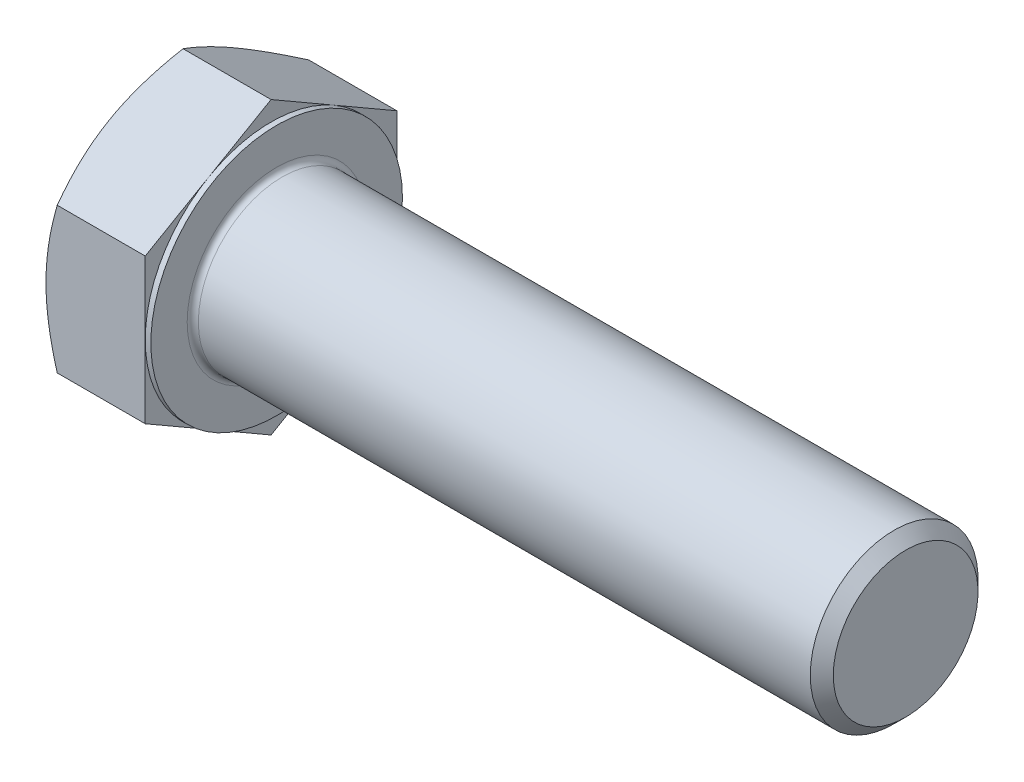
ISO-10303-21;
HEADER;
FILE_DESCRIPTION(('STEP AP214'),'2;1');
FILE_NAME('part.step','',(''),(''),'','','');
FILE_SCHEMA(('AUTOMOTIVE_DESIGN { 1 0 10303 214 1 1 1 1 }'));
ENDSEC;
DATA;
#1=APPLICATION_CONTEXT('core data for automotive mechanical design processes');
#2=APPLICATION_PROTOCOL_DEFINITION('international standard','automotive_design',2000,#1);
#3=PRODUCT_CONTEXT('',#1,'mechanical');
#4=PRODUCT('Part','Part','',(#3));
#5=PRODUCT_RELATED_PRODUCT_CATEGORY('part','',(#4));
#6=PRODUCT_DEFINITION_FORMATION('','',#4);
#7=PRODUCT_DEFINITION_CONTEXT('part definition',#1,'design');
#8=PRODUCT_DEFINITION('design','',#6,#7);
#9=PRODUCT_DEFINITION_SHAPE('','',#8);
#10=(LENGTH_UNIT() NAMED_UNIT(*) SI_UNIT(.MILLI.,.METRE.));
#11=(NAMED_UNIT(*) PLANE_ANGLE_UNIT() SI_UNIT($,.RADIAN.));
#12=(NAMED_UNIT(*) SI_UNIT($,.STERADIAN.) SOLID_ANGLE_UNIT());
#13=UNCERTAINTY_MEASURE_WITH_UNIT(LENGTH_MEASURE(1.E-05),#10,'distance_accuracy_value','');
#14=(GEOMETRIC_REPRESENTATION_CONTEXT(3) GLOBAL_UNCERTAINTY_ASSIGNED_CONTEXT((#13)) GLOBAL_UNIT_ASSIGNED_CONTEXT((#10,
#11,#12)) REPRESENTATION_CONTEXT('',''));
#15=CARTESIAN_POINT('',(0.,0.,0.));
#16=DIRECTION('',(0.,0.,1.));
#17=DIRECTION('',(1.,0.,0.));
#18=AXIS2_PLACEMENT_3D('',#15,#16,#17);
#19=CARTESIAN_POINT('',(15.,20.7846096908265,0.));
#20=DIRECTION('',(1.,0.,0.));
#21=DIRECTION('',(0.,0.,-1.));
#22=AXIS2_PLACEMENT_3D('',#19,#20,#21);
#23=PLANE('',#22);
#24=CARTESIAN_POINT('',(15.,0.,0.));
#25=DIRECTION('',(1.,0.,0.));
#26=DIRECTION('',(0.,0.,-1.));
#27=AXIS2_PLACEMENT_3D('',#24,#25,#26);
#28=CIRCLE('',#27,12.8);
#29=CARTESIAN_POINT('',(15.,0.,-12.8));
#30=VERTEX_POINT('',#29);
#31=EDGE_CURVE('E43',#30,#30,#28,.F.);
#32=ORIENTED_EDGE('',*,*,#31,.T.);
#33=EDGE_LOOP('',(#32));
#34=FACE_BOUND('',#33,.T.);
#35=CARTESIAN_POINT('',(15.,0.,0.));
#36=DIRECTION('',(1.,0.,0.));
#37=DIRECTION('',(0.,0.,-1.));
#38=AXIS2_PLACEMENT_3D('',#35,#36,#37);
#39=CIRCLE('',#38,18.);
#40=CARTESIAN_POINT('',(15.,0.,-18.));
#41=VERTEX_POINT('',#40);
#42=EDGE_CURVE('E294',#41,#41,#39,.T.);
#43=ORIENTED_EDGE('',*,*,#42,.T.);
#44=EDGE_LOOP('',(#43));
#45=FACE_BOUND('',#44,.T.);
#46=ADVANCED_FACE('F35',(#34,#45),#23,.T.);
#47=CARTESIAN_POINT('',(0.,0.,0.));
#48=DIRECTION('',(-1.,0.,0.));
#49=DIRECTION('',(0.,0.,1.));
#50=AXIS2_PLACEMENT_3D('',#47,#48,#49);
#51=CYLINDRICAL_SURFACE('',#50,12.);
#52=CARTESIAN_POINT('',(15.8,0.,0.));
#53=DIRECTION('',(1.,0.,0.));
#54=DIRECTION('',(0.,0.,-1.));
#55=AXIS2_PLACEMENT_3D('',#52,#53,#54);
#56=CIRCLE('',#55,12.);
#57=CARTESIAN_POINT('',(15.8,0.,-12.));
#58=VERTEX_POINT('',#57);
#59=EDGE_CURVE('E11',#58,#58,#56,.T.);
#60=ORIENTED_EDGE('',*,*,#59,.T.);
#61=EDGE_LOOP('',(#60));
#62=FACE_BOUND('',#61,.T.);
#63=CARTESIAN_POINT('',(103.352,0.,0.));
#64=DIRECTION('',(-1.,0.,0.));
#65=DIRECTION('',(0.,0.,1.));
#66=AXIS2_PLACEMENT_3D('',#63,#64,#65);
#67=CIRCLE('',#66,12.);
#68=CARTESIAN_POINT('',(103.352,0.,12.));
#69=VERTEX_POINT('',#68);
#70=EDGE_CURVE('E273',#69,#69,#67,.T.);
#71=ORIENTED_EDGE('',*,*,#70,.T.);
#72=EDGE_LOOP('',(#71));
#73=FACE_BOUND('',#72,.T.);
#74=ADVANCED_FACE('F247',(#62,#73),#51,.T.);
#75=CARTESIAN_POINT('',(105.,0.,0.));
#76=DIRECTION('',(-1.,0.,0.));
#77=DIRECTION('',(0.,0.,1.));
#78=AXIS2_PLACEMENT_3D('',#75,#76,#77);
#79=CONICAL_SURFACE('',#78,10.352,0.785398163397449);
#80=ORIENTED_EDGE('',*,*,#70,.F.);
#81=EDGE_LOOP('',(#80));
#82=FACE_BOUND('',#81,.T.);
#83=CARTESIAN_POINT('',(105.,0.,0.));
#84=DIRECTION('',(-1.,0.,0.));
#85=DIRECTION('',(0.,0.,1.));
#86=AXIS2_PLACEMENT_3D('',#83,#84,#85);
#87=CIRCLE('',#86,10.352);
#88=CARTESIAN_POINT('',(105.,0.,10.352));
#89=VERTEX_POINT('',#88);
#90=EDGE_CURVE('E271',#89,#89,#87,.T.);
#91=ORIENTED_EDGE('',*,*,#90,.T.);
#92=EDGE_LOOP('',(#91));
#93=FACE_BOUND('',#92,.T.);
#94=ADVANCED_FACE('F252',(#82,#93),#79,.T.);
#95=CARTESIAN_POINT('',(105.,0.,0.));
#96=DIRECTION('',(-1.,0.,0.));
#97=DIRECTION('',(0.,0.,1.));
#98=AXIS2_PLACEMENT_3D('',#95,#96,#97);
#99=PLANE('',#98);
#100=ORIENTED_EDGE('',*,*,#90,.F.);
#101=EDGE_LOOP('',(#100));
#102=FACE_BOUND('',#101,.T.);
#103=ADVANCED_FACE('F259',(#102),#99,.F.);
#104=CARTESIAN_POINT('',(14.2,18.,0.));
#105=DIRECTION('',(1.,0.,0.));
#106=DIRECTION('',(0.,0.,-1.));
#107=AXIS2_PLACEMENT_3D('',#104,#105,#106);
#108=PLANE('',#107);
#109=DIRECTION('',(0.,0.500000000000001,0.866025403784438));
#110=VECTOR('',#109,1.);
#111=CARTESIAN_POINT('',(14.2,10.3923048454132,-18.));
#112=LINE('',#111,#110);
#113=CARTESIAN_POINT('',(14.2,10.3923048454132,-18.));
#114=VERTEX_POINT('',#113);
#115=CARTESIAN_POINT('',(14.2,15.5884572681199,-9.00000000000002));
#116=VERTEX_POINT('',#115);
#117=EDGE_CURVE('E167',#114,#116,#112,.T.);
#118=ORIENTED_EDGE('',*,*,#117,.T.);
#119=CARTESIAN_POINT('',(14.2,0.,0.));
#120=DIRECTION('',(-1.,0.,0.));
#121=DIRECTION('',(0.,0.,1.));
#122=AXIS2_PLACEMENT_3D('',#119,#120,#121);
#123=CIRCLE('',#122,18.);
#124=CARTESIAN_POINT('',(14.2,0.,-18.));
#125=VERTEX_POINT('',#124);
#126=EDGE_CURVE('E50',#116,#125,#123,.T.);
#127=ORIENTED_EDGE('',*,*,#126,.T.);
#128=DIRECTION('',(0.,1.,0.));
#129=VECTOR('',#128,1.);
#130=CARTESIAN_POINT('',(14.2,10.3923048454132,-18.));
#131=LINE('',#130,#129);
#132=EDGE_CURVE('E297',#125,#114,#131,.T.);
#133=ORIENTED_EDGE('',*,*,#132,.T.);
#134=EDGE_LOOP('',(#118,#127,#133));
#135=FACE_BOUND('',#134,.T.);
#136=ADVANCED_FACE('F262',(#135),#108,.T.);
#137=CARTESIAN_POINT('',(14.2,20.7846096908265,0.));
#138=VERTEX_POINT('',#137);
#139=EDGE_CURVE('E165',#116,#138,#112,.T.);
#140=ORIENTED_EDGE('',*,*,#139,.T.);
#141=DIRECTION('',(0.,-0.500000000000001,0.866025403784438));
#142=VECTOR('',#141,1.);
#143=CARTESIAN_POINT('',(14.2,20.7846096908265,0.));
#144=LINE('',#143,#142);
#145=CARTESIAN_POINT('',(14.2,15.5884572681199,9.00000000000002));
#146=VERTEX_POINT('',#145);
#147=EDGE_CURVE('E164',#138,#146,#144,.T.);
#148=ORIENTED_EDGE('',*,*,#147,.T.);
#149=EDGE_CURVE('E153',#146,#116,#123,.T.);
#150=ORIENTED_EDGE('',*,*,#149,.T.);
#151=EDGE_LOOP('',(#140,#148,#150));
#152=FACE_BOUND('',#151,.T.);
#153=ADVANCED_FACE('F267',(#152),#108,.T.);
#154=CARTESIAN_POINT('',(14.2,10.3923048454133,18.));
#155=VERTEX_POINT('',#154);
#156=EDGE_CURVE('E132',#146,#155,#144,.T.);
#157=ORIENTED_EDGE('',*,*,#156,.T.);
#158=DIRECTION('',(0.,-1.,0.));
#159=VECTOR('',#158,1.);
#160=CARTESIAN_POINT('',(14.2,10.3923048454133,18.));
#161=LINE('',#160,#159);
#162=CARTESIAN_POINT('',(14.2,0.,18.));
#163=VERTEX_POINT('',#162);
#164=EDGE_CURVE('E126',#155,#163,#161,.T.);
#165=ORIENTED_EDGE('',*,*,#164,.T.);
#166=EDGE_CURVE('E130',#163,#146,#123,.T.);
#167=ORIENTED_EDGE('',*,*,#166,.T.);
#168=EDGE_LOOP('',(#157,#165,#167));
#169=FACE_BOUND('',#168,.T.);
#170=ADVANCED_FACE('F128',(#169),#108,.T.);
#171=CARTESIAN_POINT('',(14.2,-10.3923048454132,18.));
#172=VERTEX_POINT('',#171);
#173=EDGE_CURVE('E136',#163,#172,#161,.T.);
#174=ORIENTED_EDGE('',*,*,#173,.T.);
#175=DIRECTION('',(0.,-0.500000000000002,-0.866025403784438));
#176=VECTOR('',#175,1.);
#177=CARTESIAN_POINT('',(14.2,-20.7846096908265,0.));
#178=LINE('',#177,#176);
#179=CARTESIAN_POINT('',(14.2,-15.5884572681199,9.00000000000003));
#180=VERTEX_POINT('',#179);
#181=EDGE_CURVE('E143',#172,#180,#178,.T.);
#182=ORIENTED_EDGE('',*,*,#181,.T.);
#183=EDGE_CURVE('E140',#180,#163,#123,.T.);
#184=ORIENTED_EDGE('',*,*,#183,.T.);
#185=EDGE_LOOP('',(#174,#182,#184));
#186=FACE_BOUND('',#185,.T.);
#187=ADVANCED_FACE('F141',(#186),#108,.T.);
#188=CARTESIAN_POINT('',(14.2,-20.7846096908265,0.));
#189=VERTEX_POINT('',#188);
#190=EDGE_CURVE('E159',#180,#189,#178,.T.);
#191=ORIENTED_EDGE('',*,*,#190,.T.);
#192=DIRECTION('',(0.,0.5,-0.866025403784439));
#193=VECTOR('',#192,1.);
#194=CARTESIAN_POINT('',(14.2,-10.3923048454133,-18.));
#195=LINE('',#194,#193);
#196=CARTESIAN_POINT('',(14.2,-15.5884572681199,-8.99999999999999));
#197=VERTEX_POINT('',#196);
#198=EDGE_CURVE('E335',#189,#197,#195,.T.);
#199=ORIENTED_EDGE('',*,*,#198,.T.);
#200=EDGE_CURVE('E147',#197,#180,#123,.T.);
#201=ORIENTED_EDGE('',*,*,#200,.T.);
#202=EDGE_LOOP('',(#191,#199,#201));
#203=FACE_BOUND('',#202,.T.);
#204=ADVANCED_FACE('F336',(#203),#108,.T.);
#205=CARTESIAN_POINT('',(14.2,-10.3923048454133,-18.));
#206=VERTEX_POINT('',#205);
#207=EDGE_CURVE('E154',#197,#206,#195,.T.);
#208=ORIENTED_EDGE('',*,*,#207,.T.);
#209=EDGE_CURVE('E298',#206,#125,#131,.T.);
#210=ORIENTED_EDGE('',*,*,#209,.T.);
#211=EDGE_CURVE('E305',#125,#197,#123,.T.);
#212=ORIENTED_EDGE('',*,*,#211,.T.);
#213=EDGE_LOOP('',(#208,#210,#212));
#214=FACE_BOUND('',#213,.T.);
#215=ADVANCED_FACE('F268',(#214),#108,.T.);
#216=CARTESIAN_POINT('',(0.,0.,0.));
#217=DIRECTION('',(-1.,0.,0.));
#218=DIRECTION('',(0.,0.,1.));
#219=AXIS2_PLACEMENT_3D('',#216,#217,#218);
#220=CYLINDRICAL_SURFACE('',#219,18.);
#221=ORIENTED_EDGE('',*,*,#126,.F.);
#222=ORIENTED_EDGE('',*,*,#149,.F.);
#223=ORIENTED_EDGE('',*,*,#166,.F.);
#224=ORIENTED_EDGE('',*,*,#183,.F.);
#225=ORIENTED_EDGE('',*,*,#200,.F.);
#226=ORIENTED_EDGE('',*,*,#211,.F.);
#227=EDGE_LOOP('',(#221,#222,#223,#224,#225,#226));
#228=FACE_BOUND('',#227,.T.);
#229=ORIENTED_EDGE('',*,*,#42,.F.);
#230=EDGE_LOOP('',(#229));
#231=FACE_BOUND('',#230,.T.);
#232=ADVANCED_FACE('F150',(#228,#231),#220,.T.);
#233=CARTESIAN_POINT('',(0.,20.7846096908265,0.));
#234=DIRECTION('',(1.,0.,0.));
#235=DIRECTION('',(0.,0.,-1.));
#236=AXIS2_PLACEMENT_3D('',#233,#234,#235);
#237=PLANE('',#236);
#238=CARTESIAN_POINT('',(0.,0.,0.));
#239=DIRECTION('',(1.,0.,0.));
#240=DIRECTION('',(0.,0.,-1.));
#241=AXIS2_PLACEMENT_3D('',#238,#239,#240);
#242=CIRCLE('',#241,18.);
#243=CARTESIAN_POINT('',(0.,0.,-18.));
#244=VERTEX_POINT('',#243);
#245=CARTESIAN_POINT('',(0.,15.5884572681199,-9.00000000000002));
#246=VERTEX_POINT('',#245);
#247=EDGE_CURVE('E293',#244,#246,#242,.T.);
#248=ORIENTED_EDGE('',*,*,#247,.F.);
#249=CARTESIAN_POINT('',(0.,-15.5884572681199,-8.99999999999999));
#250=VERTEX_POINT('',#249);
#251=EDGE_CURVE('E289',#250,#244,#242,.T.);
#252=ORIENTED_EDGE('',*,*,#251,.F.);
#253=CARTESIAN_POINT('',(0.,-15.5884572681199,9.00000000000004));
#254=VERTEX_POINT('',#253);
#255=EDGE_CURVE('E292',#254,#250,#242,.T.);
#256=ORIENTED_EDGE('',*,*,#255,.F.);
#257=CARTESIAN_POINT('',(0.,0.,18.));
#258=VERTEX_POINT('',#257);
#259=EDGE_CURVE('E328',#258,#254,#242,.T.);
#260=ORIENTED_EDGE('',*,*,#259,.F.);
#261=CARTESIAN_POINT('',(0.,0.,0.));
#262=DIRECTION('',(-1.,0.,0.));
#263=DIRECTION('',(0.,0.,1.));
#264=AXIS2_PLACEMENT_3D('',#261,#262,#263);
#265=CIRCLE('',#264,18.);
#266=CARTESIAN_POINT('',(0.,15.5884572681199,9.00000000000002));
#267=VERTEX_POINT('',#266);
#268=EDGE_CURVE('E168',#258,#267,#265,.T.);
#269=ORIENTED_EDGE('',*,*,#268,.T.);
#270=EDGE_CURVE('E351',#246,#267,#242,.T.);
#271=ORIENTED_EDGE('',*,*,#270,.F.);
#272=EDGE_LOOP('',(#248,#252,#256,#260,#269,#271));
#273=FACE_BOUND('',#272,.T.);
#274=ADVANCED_FACE('F197',(#273),#237,.F.);
#275=CARTESIAN_POINT('',(0.,0.,0.));
#276=DIRECTION('',(1.,0.,0.));
#277=DIRECTION('',(0.,0.,-1.));
#278=AXIS2_PLACEMENT_3D('',#275,#276,#277);
#279=CONICAL_SURFACE('',#278,18.,1.0471975511966);
#280=CARTESIAN_POINT('',(1.60776182180894,10.3921893753594,18.0002));
#281=CARTESIAN_POINT('',(1.47589336556312,10.6206079566545,17.6045674118041));
#282=CARTESIAN_POINT('',(1.35000889021179,10.8499174930169,17.2073916441644));
#283=CARTESIAN_POINT('',(1.11187123611098,11.310375356009,16.4098552307175));
#284=CARTESIAN_POINT('',(0.999622540659326,11.5415242609305,16.0094935832795));
#285=CARTESIAN_POINT('',(0.790265297583962,12.0061075993295,15.2048116368225));
#286=CARTESIAN_POINT('',(0.693192573141009,12.2395460983593,14.8004842960602));
#287=CARTESIAN_POINT('',(0.51627174378766,12.7080451523823,13.9890201311945));
#288=CARTESIAN_POINT('',(0.436422652420739,12.9431056136839,13.5818834693696));
#289=CARTESIAN_POINT('',(0.297345302854857,13.4088255484441,12.7752328802672));
#290=CARTESIAN_POINT('',(0.237656723113625,13.6394504469968,12.3757788384836));
#291=CARTESIAN_POINT('',(0.137572375669447,14.1017570002651,11.5750403995507));
#292=CARTESIAN_POINT('',(0.0971769793251351,14.3334386752352,11.1737559673198));
#293=CARTESIAN_POINT('',(0.0366989588175636,14.7971912077607,10.3705130188471));
#294=CARTESIAN_POINT('',(0.0165921970388509,15.0292612730516,9.96855587484738));
#295=CARTESIAN_POINT('',(-0.0028761460025901,15.4936156120144,9.16427056704863));
#296=CARTESIAN_POINT('',(-0.00223836829112426,15.7258998788456,8.76194241509822));
#297=CARTESIAN_POINT('',(0.0183335794963803,16.1601606713826,8.00978065868889));
#298=CARTESIAN_POINT('',(0.0357591844006476,16.3621681381522,7.65989346273577));
#299=CARTESIAN_POINT('',(0.0859690685012189,16.765701206145,6.96095368643809));
#300=CARTESIAN_POINT('',(0.118753127736271,16.9672268142278,6.61190109421242));
#301=CARTESIAN_POINT('',(0.199111057578684,17.3697198122039,5.91476277202716));
#302=CARTESIAN_POINT('',(0.246698302564829,17.5706865308241,5.56667820474646));
#303=CARTESIAN_POINT('',(0.355822876567441,17.9716632799777,4.87216610255867));
#304=CARTESIAN_POINT('',(0.417360146472634,18.1716733145612,4.52573856063651));
#305=CARTESIAN_POINT('',(0.624462075708563,18.7788295665707,3.47411308402299));
#306=CARTESIAN_POINT('',(0.790677467933145,19.1842175215698,2.77196054918801));
#307=CARTESIAN_POINT('',(1.1679181702988,19.9889486858692,1.37812528618742));
#308=CARTESIAN_POINT('',(1.3788548871277,20.3883021980098,0.686424712978885));
#309=CARTESIAN_POINT('',(1.60776182180895,20.7847251608804,-0.000200000000000834));
#310=B_SPLINE_CURVE_WITH_KNOTS('',3,(#280,#281,#282,#283,#284,#285,#286,#287,#288,#289,#290,
#291,#292,#293,#294,#295,#296,#297,#298,#299,#300,#301,#302,#303,#304,#305,#306,#307,#308,#309),
.UNSPECIFIED.,.F.,.F.,(4,2,2,2,2,2,2,2,2,2,2,2,2,2,4),(0.,1.42650335783822,2.85347447244913,
4.28376471280638,5.71397301377359,7.10888071673008,8.50381526803681,9.8970882864255,
11.2903182514068,12.5031974791544,13.7160593367768,14.9300201888636,16.1439758970578,
18.6253607678546,21.1018751738864),.UNSPECIFIED.);
#311=CARTESIAN_POINT('',(1.60769515458673,20.7846096908265,0.));
#312=VERTEX_POINT('',#311);
#313=EDGE_CURVE('E216',#267,#312,#310,.T.);
#314=ORIENTED_EDGE('',*,*,#313,.T.);
#315=CARTESIAN_POINT('',(1.60776182180895,20.7847251608804,0.000200000000000836));
#316=CARTESIAN_POINT('',(1.47589336556313,20.5563065795853,-0.395432588195887));
#317=CARTESIAN_POINT('',(1.3500088902118,20.3269970432229,-0.792608355835558));
#318=CARTESIAN_POINT('',(1.11187123611099,19.8665391802308,-1.59014476928247));
#319=CARTESIAN_POINT('',(0.999622540659336,19.6353902753093,-1.99050641672051));
#320=CARTESIAN_POINT('',(0.790265297583971,19.1708069369103,-2.79518836317754));
#321=CARTESIAN_POINT('',(0.693192573141017,18.9373684378805,-3.19951570393978));
#322=CARTESIAN_POINT('',(0.516271743787666,18.4688693838575,-4.01097986880547));
#323=CARTESIAN_POINT('',(0.436422652420744,18.2338089225559,-4.41811653063042));
#324=CARTESIAN_POINT('',(0.29734530285486,17.7680889877957,-5.22476711973284));
#325=CARTESIAN_POINT('',(0.237656723113628,17.537464089243,-5.62422116151642));
#326=CARTESIAN_POINT('',(0.137572375669449,17.0751575359747,-6.42495960044929));
#327=CARTESIAN_POINT('',(0.0971769793251374,16.8434758610046,-6.82624403268017));
#328=CARTESIAN_POINT('',(0.0366989588175652,16.3797233284791,-7.62948698115295));
#329=CARTESIAN_POINT('',(0.0165921970388512,16.1476532631882,-8.03144412515262));
#330=CARTESIAN_POINT('',(-0.00287614600259145,15.6832989242254,-8.83572943295137));
#331=CARTESIAN_POINT('',(-0.00223836829112604,15.4510146573942,-9.23805758490178));
#332=CARTESIAN_POINT('',(0.0183335794963781,15.0167538648571,-9.99021934131111));
#333=CARTESIAN_POINT('',(0.0357591844006452,14.8147463980876,-10.3401065372642));
#334=CARTESIAN_POINT('',(0.0859690685012147,14.4112133300948,-11.0390463135619));
#335=CARTESIAN_POINT('',(0.118753127736265,14.209687722012,-11.3880989057876));
#336=CARTESIAN_POINT('',(0.199111057578677,13.8071947240359,-12.0852372279728));
#337=CARTESIAN_POINT('',(0.246698302564822,13.6062280054156,-12.4333217952535));
#338=CARTESIAN_POINT('',(0.355822876567433,13.2052512562621,-13.1278338974413));
#339=CARTESIAN_POINT('',(0.417360146472625,13.0052412216786,-13.4742614393635));
#340=CARTESIAN_POINT('',(0.624462075708551,12.3980849696691,-14.525886915977));
#341=CARTESIAN_POINT('',(0.790677467933134,11.99269701467,-15.228039450812));
#342=CARTESIAN_POINT('',(1.16791817029879,11.1879658503706,-16.6218747138126));
#343=CARTESIAN_POINT('',(1.37885488712769,10.78861233823,-17.3135752870211));
#344=CARTESIAN_POINT('',(1.60776182180894,10.3921893753594,-18.0002));
#345=B_SPLINE_CURVE_WITH_KNOTS('',3,(#315,#316,#317,#318,#319,#320,#321,#322,#323,#324,#325,
#326,#327,#328,#329,#330,#331,#332,#333,#334,#335,#336,#337,#338,#339,#340,#341,#342,#343,#344),
.UNSPECIFIED.,.F.,.F.,(4,2,2,2,2,2,2,2,2,2,2,2,2,2,4),(0.,1.42650335783821,2.85347447244913,
4.28376471280638,5.71397301377359,7.10888071673009,8.50381526803682,9.89708828642551,
11.2903182514068,12.5031974791545,13.7160593367768,14.9300201888636,16.1439758970578,
18.6253607678546,21.1018751738864),.UNSPECIFIED.);
#346=EDGE_CURVE('E58',#312,#246,#345,.T.);
#347=ORIENTED_EDGE('',*,*,#346,.T.);
#348=ORIENTED_EDGE('',*,*,#270,.T.);
#349=EDGE_LOOP('',(#314,#347,#348));
#350=FACE_BOUND('',#349,.T.);
#351=ADVANCED_FACE('F352',(#350),#279,.T.);
#352=CARTESIAN_POINT('',(8.808427130496,-27.9643402431046,18.));
#353=CARTESIAN_POINT('',(8.61750677802229,-27.5710662073959,18.));
#354=CARTESIAN_POINT('',(8.42753472732277,-27.1773320233033,18.));
#355=CARTESIAN_POINT('',(8.04970189891834,-26.3888473520457,18.));
#356=CARTESIAN_POINT('',(7.86184114230335,-25.9940968547769,18.));
#357=CARTESIAN_POINT('',(7.30169863346519,-24.8080724634241,18.));
#358=CARTESIAN_POINT('',(6.93291289399547,-24.0151412252697,18.));
#359=CARTESIAN_POINT('',(6.20490967153255,-22.4196974027513,18.));
#360=CARTESIAN_POINT('',(5.84575478283093,-21.6171561882138,18.));
#361=CARTESIAN_POINT('',(5.14207064659814,-20.0057089274192,18.));
#362=CARTESIAN_POINT('',(4.79754071148437,-19.1968031825104,18.));
#363=CARTESIAN_POINT('',(4.11611022257428,-17.5450041866493,18.));
#364=CARTESIAN_POINT('',(3.77981809482908,-16.7018586270337,18.));
#365=CARTESIAN_POINT('',(3.13256514784992,-15.0057154320914,18.));
#366=CARTESIAN_POINT('',(2.82160716489197,-14.1527167058291,18.));
#367=CARTESIAN_POINT('',(2.23315455016408,-12.43711867356,18.));
#368=CARTESIAN_POINT('',(1.95559259436132,-11.5745426460692,18.));
#369=CARTESIAN_POINT('',(1.44279031196762,-9.83693542713535,18.));
#370=CARTESIAN_POINT('',(1.20753670684013,-8.96190823687535,18.));
#371=CARTESIAN_POINT('',(0.895522308058553,-7.64230427801033,18.));
#372=CARTESIAN_POINT('',(0.798539960307999,-7.20248011867895,18.));
#373=CARTESIAN_POINT('',(0.61934666397991,-6.31981731439132,18.));
#374=CARTESIAN_POINT('',(0.537135413912321,-5.87697873115342,18.));
#375=CARTESIAN_POINT('',(0.388933808123912,-4.98859702789482,18.));
#376=CARTESIAN_POINT('',(0.322942911246029,-4.54305399861045,18.));
#377=CARTESIAN_POINT('',(0.208492383577689,-3.64970631100975,18.));
#378=CARTESIAN_POINT('',(0.160032741349877,-3.20190165416909,18.));
#379=CARTESIAN_POINT('',(0.0822220075298186,-2.31054962941571,18.));
#380=CARTESIAN_POINT('',(0.0526283717185129,-1.86702356479736,18.));
#381=CARTESIAN_POINT('',(0.012226539215199,-0.979118128922018,18.));
#382=CARTESIAN_POINT('',(0.00141802963593598,-0.534738772000976,18.));
#383=CARTESIAN_POINT('',(-0.00115631762080865,0.35407970684775,18.));
#384=CARTESIAN_POINT('',(0.00707792061225486,0.798518829006617,18.));
#385=CARTESIAN_POINT('',(0.0423876675323175,1.68665283494852,18.));
#386=CARTESIAN_POINT('',(0.069464021130165,2.13034768446277,18.));
#387=CARTESIAN_POINT('',(0.156482092926351,3.19520589070312,18.));
#388=CARTESIAN_POINT('',(0.225281528377599,3.81565824171455,18.));
#389=CARTESIAN_POINT('',(0.395990058380339,5.05199420564998,18.));
#390=CARTESIAN_POINT('',(0.497903614582591,5.66787719147405,18.));
#391=CARTESIAN_POINT('',(0.731215030304267,6.89447554273952,18.));
#392=CARTESIAN_POINT('',(0.862635769426437,7.50518651446561,18.));
#393=CARTESIAN_POINT('',(1.15094813703739,8.72049972355144,18.));
#394=CARTESIAN_POINT('',(1.30783938943284,9.3251020509704,18.));
#395=CARTESIAN_POINT('',(1.64698004778297,10.5414936469055,18.));
#396=CARTESIAN_POINT('',(1.82971241990763,11.1531473228725,18.));
#397=CARTESIAN_POINT('',(2.21414736076856,12.3704299751548,18.));
#398=CARTESIAN_POINT('',(2.41585005430054,12.9760589118076,18.));
#399=CARTESIAN_POINT('',(2.83501520647244,14.1815895178699,18.));
#400=CARTESIAN_POINT('',(3.05247247513773,14.7814930003558,18.));
#401=CARTESIAN_POINT('',(3.50057968346486,15.9763233426994,18.));
#402=CARTESIAN_POINT('',(3.73122947137528,16.5712502597116,18.));
#403=CARTESIAN_POINT('',(4.28861115018066,17.9702204857275,18.));
#404=CARTESIAN_POINT('',(4.62002515649325,18.7723954680034,18.));
#405=CARTESIAN_POINT('',(5.29890820133677,20.3699430824083,18.));
#406=CARTESIAN_POINT('',(5.64637822330189,21.1653152943209,18.));
#407=CARTESIAN_POINT('',(6.35417286629493,22.7505167275409,18.));
#408=CARTESIAN_POINT('',(6.7145003341077,23.5403446743747,18.));
#409=CARTESIAN_POINT('',(7.44542750445922,25.1152008413773,18.));
#410=CARTESIAN_POINT('',(7.81602698916609,25.9002291628984,18.));
#411=CARTESIAN_POINT('',(8.56599428613879,27.4671332618931,18.));
#412=CARTESIAN_POINT('',(8.94537123353963,28.2490046594181,18.));
#413=CARTESIAN_POINT('',(9.71100797362349,29.8093695492503,18.));
#414=CARTESIAN_POINT('',(10.0972677957068,30.5878630271109,18.));
#415=CARTESIAN_POINT('',(10.8754456131813,32.1418914548454,18.));
#416=CARTESIAN_POINT('',(11.2673628909044,32.9174267644653,18.));
#417=CARTESIAN_POINT('',(12.0559785801665,34.4660583569055,18.));
#418=CARTESIAN_POINT('',(12.4526769828552,35.2391546442373,18.));
#419=CARTESIAN_POINT('',(13.5822142013125,37.4263866617491,18.));
#420=CARTESIAN_POINT('',(14.3197969559458,38.8380724746762,18.));
#421=CARTESIAN_POINT('',(15.8050655327946,41.6561700073892,18.));
#422=CARTESIAN_POINT('',(16.5527517104897,43.0625815393687,18.));
#423=CARTESIAN_POINT('',(18.0539928572742,45.8677641350797,18.));
#424=CARTESIAN_POINT('',(18.8075285851389,47.2665455031668,18.));
#425=CARTESIAN_POINT('',(19.942334530836,49.3622270652889,18.));
#426=CARTESIAN_POINT('',(20.3213432724281,50.0603536788783,18.));
#427=CARTESIAN_POINT('',(21.0807116459902,51.4558704710998,18.));
#428=CARTESIAN_POINT('',(21.4610712758458,52.1532606508822,18.));
#429=CARTESIAN_POINT('',(21.8420286714726,52.850324235841,18.));
#430=B_SPLINE_CURVE_WITH_KNOTS('',3,(#352,#353,#354,#355,#356,#357,#358,#359,#360,#361,#362,
#363,#364,#365,#366,#367,#368,#369,#370,#371,#372,#373,#374,#375,#376,#377,#378,#379,#380,#381,
#382,#383,#384,#385,#386,#387,#388,#389,#390,#391,#392,#393,#394,#395,#396,#397,#398,#399,#400,
#401,#402,#403,#404,#405,#406,#407,#408,#409,#410,#411,#412,#413,#414,#415,#416,#417,#418,#419,
#420,#421,#422,#423,#424,#425,#426,#427,#428,#429),.UNSPECIFIED.,.F.,.F.,(4,2,2,2,2,2,2,2,2,2,2,
2,2,2,2,2,2,2,2,2,2,2,2,2,2,2,2,2,2,2,2,2,2,2,2,2,2,2,4),(0.,1.31149885283058,2.62301079472824,
5.24642021614437,7.88402931842207,10.5215142775822,13.2444150325257,15.9676202112372,
18.6852401997085,21.4020057650649,22.7529669019192,24.1039004614305,25.4547889438409,
26.8056765449329,28.1388267463276,29.4719547424042,30.8050880527688,32.138281146834,
34.0100119547707,35.8819950561187,37.7554347199951,39.628846723491,41.5435776020437,
43.4583210774805,45.3724366289069,47.286530166998,49.890113594,52.4938567029427,
55.0981799317037,57.7024479744958,60.3095605480866,62.9166842606504,65.5234801070603,
68.1302711287376,72.908489911859,77.6868772522354,82.4533702914907,84.8364880602421,
87.2196021009334),.UNSPECIFIED.);
#431=CARTESIAN_POINT('',(1.60769515458672,10.3923048454133,18.));
#432=VERTEX_POINT('',#431);
#433=EDGE_CURVE('E228',#258,#432,#430,.T.);
#434=ORIENTED_EDGE('',*,*,#433,.T.);
#435=EDGE_CURVE('E227',#432,#267,#310,.T.);
#436=ORIENTED_EDGE('',*,*,#435,.T.);
#437=ORIENTED_EDGE('',*,*,#268,.F.);
#438=EDGE_LOOP('',(#434,#436,#437));
#439=FACE_BOUND('',#438,.T.);
#440=ADVANCED_FACE('F322',(#439),#279,.T.);
#441=CARTESIAN_POINT('',(1.60769515458671,-10.3923048454132,18.));
#442=VERTEX_POINT('',#441);
#443=EDGE_CURVE('E274',#442,#258,#430,.T.);
#444=ORIENTED_EDGE('',*,*,#443,.T.);
#445=ORIENTED_EDGE('',*,*,#259,.T.);
#446=CARTESIAN_POINT('',(1.60776182180895,-20.7847251608804,-0.000200000000000067));
#447=CARTESIAN_POINT('',(1.47589336556313,-20.5563065795853,0.395432588195888));
#448=CARTESIAN_POINT('',(1.35000889021179,-20.3269970432229,0.79260835583556));
#449=CARTESIAN_POINT('',(1.11187123611098,-19.8665391802308,1.59014476928247));
#450=CARTESIAN_POINT('',(0.999622540659329,-19.6353902753093,1.99050641672051));
#451=CARTESIAN_POINT('',(0.790265297583964,-19.1708069369103,2.79518836317754));
#452=CARTESIAN_POINT('',(0.693192573141011,-18.9373684378805,3.19951570393978));
#453=CARTESIAN_POINT('',(0.516271743787659,-18.4688693838575,4.01097986880547));
#454=CARTESIAN_POINT('',(0.436422652420737,-18.2338089225559,4.41811653063042));
#455=CARTESIAN_POINT('',(0.297345302854853,-17.7680889877957,5.22476711973284));
#456=CARTESIAN_POINT('',(0.237656723113621,-17.537464089243,5.62422116151642));
#457=CARTESIAN_POINT('',(0.137572375669442,-17.0751575359747,6.42495960044928));
#458=CARTESIAN_POINT('',(0.0971769793251287,-16.8434758610045,6.82624403268017));
#459=CARTESIAN_POINT('',(0.0366989588175549,-16.3797233284791,7.62948698115294));
#460=CARTESIAN_POINT('',(0.0165921970388408,-16.1476532631882,8.03144412515262));
#461=CARTESIAN_POINT('',(-0.00287614600260201,-15.6832989242253,8.83572943295136));
#462=CARTESIAN_POINT('',(-0.00223836829113659,-15.4510146573942,9.23805758490178));
#463=CARTESIAN_POINT('',(0.0183335794963686,-15.0167538648571,9.9902193413111));
#464=CARTESIAN_POINT('',(0.0357591844006367,-14.8147463980876,10.3401065372642));
#465=CARTESIAN_POINT('',(0.0859690685012056,-14.4112133300948,11.0390463135619));
#466=CARTESIAN_POINT('',(0.118753127736255,-14.209687722012,11.3880989057876));
#467=CARTESIAN_POINT('',(0.199111057578666,-13.8071947240359,12.0852372279728));
#468=CARTESIAN_POINT('',(0.246698302564811,-13.6062280054156,12.4333217952535));
#469=CARTESIAN_POINT('',(0.355822876567423,-13.205251256262,13.1278338974413));
#470=CARTESIAN_POINT('',(0.417360146472615,-13.0052412216786,13.4742614393635));
#471=CARTESIAN_POINT('',(0.624462075708542,-12.3980849696691,14.525886915977));
#472=CARTESIAN_POINT('',(0.790677467933124,-11.9926970146699,15.228039450812));
#473=CARTESIAN_POINT('',(1.16791817029878,-11.1879658503706,16.6218747138126));
#474=CARTESIAN_POINT('',(1.37885488712768,-10.78861233823,17.3135752870211));
#475=CARTESIAN_POINT('',(1.60776182180893,-10.3921893753594,18.0002));
#476=B_SPLINE_CURVE_WITH_KNOTS('',3,(#446,#447,#448,#449,#450,#451,#452,#453,#454,#455,#456,
#457,#458,#459,#460,#461,#462,#463,#464,#465,#466,#467,#468,#469,#470,#471,#472,#473,#474,#475),
.UNSPECIFIED.,.F.,.F.,(4,2,2,2,2,2,2,2,2,2,2,2,2,2,4),(0.,1.42650335783821,2.85347447244913,
4.28376471280638,5.71397301377359,7.10888071673008,8.50381526803681,9.8970882864255,
11.2903182514068,12.5031974791544,13.7160593367768,14.9300201888636,16.1439758970578,
18.6253607678546,21.1018751738865),.UNSPECIFIED.);
#477=EDGE_CURVE('E218',#254,#442,#476,.T.);
#478=ORIENTED_EDGE('',*,*,#477,.T.);
#479=EDGE_LOOP('',(#444,#445,#478));
#480=FACE_BOUND('',#479,.T.);
#481=ADVANCED_FACE('F186',(#480),#279,.T.);
#482=CARTESIAN_POINT('',(1.60769515458673,-20.7846096908265,0.));
#483=VERTEX_POINT('',#482);
#484=EDGE_CURVE('E211',#483,#254,#476,.T.);
#485=ORIENTED_EDGE('',*,*,#484,.T.);
#486=ORIENTED_EDGE('',*,*,#255,.T.);
#487=CARTESIAN_POINT('',(1.60776182180895,-10.3921893753594,-18.0002));
#488=CARTESIAN_POINT('',(1.47589336556313,-10.6206079566545,-17.6045674118041));
#489=CARTESIAN_POINT('',(1.3500088902118,-10.8499174930169,-17.2073916441644));
#490=CARTESIAN_POINT('',(1.11187123611099,-11.310375356009,-16.4098552307175));
#491=CARTESIAN_POINT('',(0.999622540659336,-11.5415242609305,-16.0094935832795));
#492=CARTESIAN_POINT('',(0.790265297583972,-12.0061075993295,-15.2048116368225));
#493=CARTESIAN_POINT('',(0.693192573141018,-12.2395460983593,-14.8004842960602));
#494=CARTESIAN_POINT('',(0.516271743787668,-12.7080451523823,-13.9890201311945));
#495=CARTESIAN_POINT('',(0.436422652420747,-12.9431056136839,-13.5818834693696));
#496=CARTESIAN_POINT('',(0.297345302854864,-13.4088255484441,-12.7752328802672));
#497=CARTESIAN_POINT('',(0.237656723113632,-13.6394504469968,-12.3757788384836));
#498=CARTESIAN_POINT('',(0.137572375669453,-14.1017570002651,-11.5750403995507));
#499=CARTESIAN_POINT('',(0.0971769793251403,-14.3334386752353,-11.1737559673198));
#500=CARTESIAN_POINT('',(0.0366989588175689,-14.7971912077607,-10.370513018847));
#501=CARTESIAN_POINT('',(0.0165921970388565,-15.0292612730516,-9.96855587484737));
#502=CARTESIAN_POINT('',(-0.0028761460025847,-15.4936156120145,-9.16427056704861));
#503=CARTESIAN_POINT('',(-0.00223836829111947,-15.7258998788456,-8.7619424150982));
#504=CARTESIAN_POINT('',(0.0183335794963855,-16.1601606713827,-8.00978065868888));
#505=CARTESIAN_POINT('',(0.0357591844006535,-16.3621681381522,-7.65989346273576));
#506=CARTESIAN_POINT('',(0.085969068501224,-16.765701206145,-6.96095368643808));
#507=CARTESIAN_POINT('',(0.118753127736275,-16.9672268142278,-6.61190109421241));
#508=CARTESIAN_POINT('',(0.199111057578687,-17.3697198122039,-5.91476277202715));
#509=CARTESIAN_POINT('',(0.246698302564833,-17.5706865308241,-5.56667820474646));
#510=CARTESIAN_POINT('',(0.355822876567444,-17.9716632799777,-4.87216610255866));
#511=CARTESIAN_POINT('',(0.417360146472635,-18.1716733145612,-4.5257385606365));
#512=CARTESIAN_POINT('',(0.624462075708559,-18.7788295665707,-3.47411308402298));
#513=CARTESIAN_POINT('',(0.790677467933142,-19.1842175215698,-2.77196054918801));
#514=CARTESIAN_POINT('',(1.16791817029879,-19.9889486858692,-1.37812528618742));
#515=CARTESIAN_POINT('',(1.3788548871277,-20.3883021980098,-0.686424712978884));
#516=CARTESIAN_POINT('',(1.60776182180895,-20.7847251608804,0.000199999999999858));
#517=B_SPLINE_CURVE_WITH_KNOTS('',3,(#487,#488,#489,#490,#491,#492,#493,#494,#495,#496,#497,
#498,#499,#500,#501,#502,#503,#504,#505,#506,#507,#508,#509,#510,#511,#512,#513,#514,#515,#516),
.UNSPECIFIED.,.F.,.F.,(4,2,2,2,2,2,2,2,2,2,2,2,2,2,4),(0.,1.42650335783821,2.85347447244913,
4.28376471280638,5.71397301377359,7.10888071673009,8.50381526803682,9.89708828642551,
11.2903182514068,12.5031974791545,13.7160593367768,14.9300201888636,16.1439758970578,
18.6253607678546,21.1018751738864),.UNSPECIFIED.);
#518=EDGE_CURVE('E217',#250,#483,#517,.T.);
#519=ORIENTED_EDGE('',*,*,#518,.T.);
#520=EDGE_LOOP('',(#485,#486,#519));
#521=FACE_BOUND('',#520,.T.);
#522=ADVANCED_FACE('F350',(#521),#279,.T.);
#523=CARTESIAN_POINT('',(1.60769515458672,10.3923048454132,-18.));
#524=VERTEX_POINT('',#523);
#525=EDGE_CURVE('E219',#246,#524,#345,.T.);
#526=ORIENTED_EDGE('',*,*,#525,.T.);
#527=CARTESIAN_POINT('',(8.80842713097472,-27.9643402440907,-18.));
#528=CARTESIAN_POINT('',(8.617506778491,-27.5710662083654,-18.));
#529=CARTESIAN_POINT('',(8.42753472778147,-27.1773320242562,-18.));
#530=CARTESIAN_POINT('',(8.04970189935704,-26.3888473529655,-18.));
#531=CARTESIAN_POINT('',(7.86184114273206,-25.9940968556801,-18.));
#532=CARTESIAN_POINT('',(7.30169863386396,-24.8080724642775,-18.));
#533=CARTESIAN_POINT('',(6.93291289437432,-24.0151412260899,-18.));
#534=CARTESIAN_POINT('',(6.20490967187157,-22.4196974035044,-18.));
#535=CARTESIAN_POINT('',(5.84575478315001,-21.6171561889331,-18.));
#536=CARTESIAN_POINT('',(5.1420706468777,-20.0057089280707,-18.));
#537=CARTESIAN_POINT('',(4.79754071174434,-19.196803183128,-18.));
#538=CARTESIAN_POINT('',(4.11611022279456,-17.5450041871963,-18.));
#539=CARTESIAN_POINT('',(3.7798180950293,-16.7018586275441,-18.));
#540=CARTESIAN_POINT('',(3.1325651480111,-15.005715432528,-18.));
#541=CARTESIAN_POINT('',(2.82160716503417,-14.1527167062286,-18.));
#542=CARTESIAN_POINT('',(2.23315455027017,-12.4371186738844,-18.));
#543=CARTESIAN_POINT('',(1.95559259445028,-11.5745426463558,-18.));
#544=CARTESIAN_POINT('',(1.44279031202514,-9.8369354273451,-18.));
#545=CARTESIAN_POINT('',(1.20753670688334,-8.96190823704618,-18.));
#546=CARTESIAN_POINT('',(0.895522308081286,-7.64230427811239,-18.));
#547=CARTESIAN_POINT('',(0.798539960323235,-7.20248011875153,-18.));
#548=CARTESIAN_POINT('',(0.619346663982096,-6.31981731440452,-18.));
#549=CARTESIAN_POINT('',(0.537135413908953,-5.87697873113672,-18.));
#550=CARTESIAN_POINT('',(0.388933808111684,-4.98859702781801,-18.));
#551=CARTESIAN_POINT('',(0.322942911230495,-4.54305399850343,-18.));
#552=CARTESIAN_POINT('',(0.208492383558031,-3.64970631084204,-18.));
#553=CARTESIAN_POINT('',(0.160032741329401,-3.20190165397091,-18.));
#554=CARTESIAN_POINT('',(0.082222007510393,-2.31054962915723,-18.));
#555=CARTESIAN_POINT('',(0.0526283717009072,-1.86702356450906,-18.));
#556=CARTESIAN_POINT('',(0.0122265392038566,-0.979118128574127,-18.));
#557=CARTESIAN_POINT('',(0.0014180296290367,-0.534738771623327,-18.));
#558=CARTESIAN_POINT('',(-0.00115631761626913,0.354079707284689,-18.));
#559=CARTESIAN_POINT('',(0.00707792062379077,0.798518829473088,-18.));
#560=CARTESIAN_POINT('',(0.0423876675602103,1.68665283547366,-18.));
#561=CARTESIAN_POINT('',(0.0694640211674182,2.13034768501705,-18.));
#562=CARTESIAN_POINT('',(0.156482092986642,3.19520589130288,-18.));
#563=CARTESIAN_POINT('',(0.225281528451191,3.81565824233053,-18.));
#564=CARTESIAN_POINT('',(0.395990058481245,5.05199420629767,-18.));
#565=CARTESIAN_POINT('',(0.49790361469751,5.66787719213724,-18.));
#566=CARTESIAN_POINT('',(0.731215030447439,6.89447554343314,-18.));
#567=CARTESIAN_POINT('',(0.862635769583851,7.50518651517417,-18.));
#568=CARTESIAN_POINT('',(1.15094813722315,8.72049972428945,-18.));
#569=CARTESIAN_POINT('',(1.30783938963271,9.32510205172292,-18.));
#570=CARTESIAN_POINT('',(1.64698004801114,10.5414936476874,-18.));
#571=CARTESIAN_POINT('',(1.82971242014998,11.1531473236693,-18.));
#572=CARTESIAN_POINT('',(2.21414736103885,12.3704299759813,-18.));
#573=CARTESIAN_POINT('',(2.4158500545846,12.9760589126488,-18.));
#574=CARTESIAN_POINT('',(2.83501520678354,14.1815895187405,-18.));
#575=CARTESIAN_POINT('',(3.05247247546212,14.7814930012409,-18.));
#576=CARTESIAN_POINT('',(3.50057968381538,15.9763233436138,-18.));
#577=CARTESIAN_POINT('',(3.73122947173864,16.5712502606406,-18.));
#578=CARTESIAN_POINT('',(4.28861115056411,17.9702204866666,-18.));
#579=CARTESIAN_POINT('',(4.62002515688315,18.7723954689383,-18.));
#580=CARTESIAN_POINT('',(5.29890820173806,20.3699430833353,-18.));
#581=CARTESIAN_POINT('',(5.64637822370813,21.1653152952441,-18.));
#582=CARTESIAN_POINT('',(6.35417286670989,22.750516728457,-18.));
#583=CARTESIAN_POINT('',(6.71450033452646,23.5403446752873,-18.));
#584=CARTESIAN_POINT('',(7.44542750488467,25.1152008422835,-18.));
#585=CARTESIAN_POINT('',(7.81602698959445,25.9002291638017,-18.));
#586=CARTESIAN_POINT('',(8.56599428657223,27.4671332627904,-18.));
#587=CARTESIAN_POINT('',(8.94537123397526,28.2490046603126,-18.));
#588=CARTESIAN_POINT('',(9.71100797406294,29.8093695501392,-18.));
#589=CARTESIAN_POINT('',(10.0972677961478,30.5878630279972,-18.));
#590=CARTESIAN_POINT('',(10.8754456136253,32.1418914557266,-18.));
#591=CARTESIAN_POINT('',(11.2673628913496,32.9174267653441,-18.));
#592=CARTESIAN_POINT('',(12.0559785806139,34.4660583577795,-18.));
#593=CARTESIAN_POINT('',(12.4526769833034,35.239154645109,-18.));
#594=CARTESIAN_POINT('',(13.5822142017647,37.4263866626177,-18.));
#595=CARTESIAN_POINT('',(14.3197969564005,38.8380724755441,-18.));
#596=CARTESIAN_POINT('',(15.805065533254,41.656170008256,-18.));
#597=CARTESIAN_POINT('',(16.5527517109513,43.062581540235,-18.));
#598=CARTESIAN_POINT('',(18.0539928577398,45.8677641359459,-18.));
#599=CARTESIAN_POINT('',(18.8075285856065,47.2665455040334,-18.));
#600=CARTESIAN_POINT('',(19.9423345313063,49.362227066156,-18.));
#601=CARTESIAN_POINT('',(20.3213432728994,50.0603536797457,-18.));
#602=CARTESIAN_POINT('',(21.0807116464631,51.4558704719676,-18.));
#603=CARTESIAN_POINT('',(21.4610712763196,52.1532606517502,-18.));
#604=CARTESIAN_POINT('',(21.8420286719472,52.8503242367093,-18.));
#605=B_SPLINE_CURVE_WITH_KNOTS('',3,(#527,#528,#529,#530,#531,#532,#533,#534,#535,#536,#537,
#538,#539,#540,#541,#542,#543,#544,#545,#546,#547,#548,#549,#550,#551,#552,#553,#554,#555,#556,
#557,#558,#559,#560,#561,#562,#563,#564,#565,#566,#567,#568,#569,#570,#571,#572,#573,#574,#575,
#576,#577,#578,#579,#580,#581,#582,#583,#584,#585,#586,#587,#588,#589,#590,#591,#592,#593,#594,
#595,#596,#597,#598,#599,#600,#601,#602,#603,#604),.UNSPECIFIED.,.F.,.F.,(4,2,2,2,2,2,2,2,2,2,2,
2,2,2,2,2,2,2,2,2,2,2,2,2,2,2,2,2,2,2,2,2,2,2,2,2,2,2,4),(0.,1.31149885288839,2.62301079484386,
5.24642021637564,7.88402931877025,10.5215142780473,13.244415033115,15.9676202119508,
18.6852402005459,21.4020057660261,22.7529669029715,24.1039004625739,25.4547889450755,
26.8056765462585,28.138826747742,29.4719547439074,30.805088054361,32.1382811485151,
34.0100119565044,35.8819950579052,37.7554347218344,39.6288467253831,41.5435776039908,
43.4583210794826,45.3724366309638,47.2865301691098,49.8901135961075,52.4938567050458,
55.0981799338023,57.70244797659,60.3095605501759,62.9166842627348,65.5234801091398,
68.1302711308122,72.9084899139354,77.6868772543136,82.4533702935725,84.8364880623258,
87.219602103019),.UNSPECIFIED.);
#606=EDGE_CURVE('E179',#524,#244,#605,.F.);
#607=ORIENTED_EDGE('',*,*,#606,.T.);
#608=ORIENTED_EDGE('',*,*,#247,.T.);
#609=EDGE_LOOP('',(#526,#607,#608));
#610=FACE_BOUND('',#609,.T.);
#611=ADVANCED_FACE('F347',(#610),#279,.T.);
#612=CARTESIAN_POINT('',(1.60769515458673,-10.3923048454133,-18.));
#613=VERTEX_POINT('',#612);
#614=EDGE_CURVE('E180',#613,#250,#517,.T.);
#615=ORIENTED_EDGE('',*,*,#614,.T.);
#616=ORIENTED_EDGE('',*,*,#251,.T.);
#617=EDGE_CURVE('E171',#244,#613,#605,.F.);
#618=ORIENTED_EDGE('',*,*,#617,.T.);
#619=EDGE_LOOP('',(#615,#616,#618));
#620=FACE_BOUND('',#619,.T.);
#621=ADVANCED_FACE('F195',(#620),#279,.T.);
#622=CARTESIAN_POINT('',(15.,10.3923048454132,-18.));
#623=DIRECTION('',(0.,0.,1.));
#624=DIRECTION('',(0.,-1.,0.));
#625=AXIS2_PLACEMENT_3D('',#622,#623,#624);
#626=PLANE('',#625);
#627=ORIENTED_EDGE('',*,*,#209,.F.);
#628=DIRECTION('',(-1.,0.,0.));
#629=VECTOR('',#628,1.);
#630=CARTESIAN_POINT('',(15.,-10.3923048454133,-18.));
#631=LINE('',#630,#629);
#632=EDGE_CURVE('E280',#206,#613,#631,.T.);
#633=ORIENTED_EDGE('',*,*,#632,.T.);
#634=ORIENTED_EDGE('',*,*,#617,.F.);
#635=ORIENTED_EDGE('',*,*,#606,.F.);
#636=DIRECTION('',(-1.,0.,0.));
#637=VECTOR('',#636,1.);
#638=CARTESIAN_POINT('',(15.,10.3923048454132,-18.));
#639=LINE('',#638,#637);
#640=EDGE_CURVE('E276',#114,#524,#639,.T.);
#641=ORIENTED_EDGE('',*,*,#640,.F.);
#642=ORIENTED_EDGE('',*,*,#132,.F.);
#643=EDGE_LOOP('',(#627,#633,#634,#635,#641,#642));
#644=FACE_BOUND('',#643,.T.);
#645=ADVANCED_FACE('F190',(#644),#626,.F.);
#646=CARTESIAN_POINT('',(15.,-10.3923048454133,-18.));
#647=DIRECTION('',(0.,0.866025403784439,0.5));
#648=DIRECTION('',(0.,-0.5,0.866025403784439));
#649=AXIS2_PLACEMENT_3D('',#646,#647,#648);
#650=PLANE('',#649);
#651=ORIENTED_EDGE('',*,*,#198,.F.);
#652=DIRECTION('',(-1.,0.,0.));
#653=VECTOR('',#652,1.);
#654=CARTESIAN_POINT('',(15.,-20.7846096908265,0.));
#655=LINE('',#654,#653);
#656=EDGE_CURVE('E282',#189,#483,#655,.T.);
#657=ORIENTED_EDGE('',*,*,#656,.T.);
#658=ORIENTED_EDGE('',*,*,#518,.F.);
#659=ORIENTED_EDGE('',*,*,#614,.F.);
#660=ORIENTED_EDGE('',*,*,#632,.F.);
#661=ORIENTED_EDGE('',*,*,#207,.F.);
#662=EDGE_LOOP('',(#651,#657,#658,#659,#660,#661));
#663=FACE_BOUND('',#662,.T.);
#664=ADVANCED_FACE('F194',(#663),#650,.F.);
#665=CARTESIAN_POINT('',(15.,-20.7846096908265,0.));
#666=DIRECTION('',(0.,0.866025403784437,-0.500000000000002));
#667=DIRECTION('',(0.,0.500000000000002,0.866025403784438));
#668=AXIS2_PLACEMENT_3D('',#665,#666,#667);
#669=PLANE('',#668);
#670=ORIENTED_EDGE('',*,*,#181,.F.);
#671=DIRECTION('',(-1.,0.,0.));
#672=VECTOR('',#671,1.);
#673=CARTESIAN_POINT('',(15.,-10.3923048454132,18.));
#674=LINE('',#673,#672);
#675=EDGE_CURVE('E158',#172,#442,#674,.T.);
#676=ORIENTED_EDGE('',*,*,#675,.T.);
#677=ORIENTED_EDGE('',*,*,#477,.F.);
#678=ORIENTED_EDGE('',*,*,#484,.F.);
#679=ORIENTED_EDGE('',*,*,#656,.F.);
#680=ORIENTED_EDGE('',*,*,#190,.F.);
#681=EDGE_LOOP('',(#670,#676,#677,#678,#679,#680));
#682=FACE_BOUND('',#681,.T.);
#683=ADVANCED_FACE('F202',(#682),#669,.F.);
#684=CARTESIAN_POINT('',(15.,10.3923048454133,18.));
#685=DIRECTION('',(0.,0.,-1.));
#686=DIRECTION('',(0.,1.,0.));
#687=AXIS2_PLACEMENT_3D('',#684,#685,#686);
#688=PLANE('',#687);
#689=ORIENTED_EDGE('',*,*,#164,.F.);
#690=DIRECTION('',(-1.,0.,0.));
#691=VECTOR('',#690,1.);
#692=CARTESIAN_POINT('',(15.,10.3923048454133,18.));
#693=LINE('',#692,#691);
#694=EDGE_CURVE('E285',#155,#432,#693,.T.);
#695=ORIENTED_EDGE('',*,*,#694,.T.);
#696=ORIENTED_EDGE('',*,*,#433,.F.);
#697=ORIENTED_EDGE('',*,*,#443,.F.);
#698=ORIENTED_EDGE('',*,*,#675,.F.);
#699=ORIENTED_EDGE('',*,*,#173,.F.);
#700=EDGE_LOOP('',(#689,#695,#696,#697,#698,#699));
#701=FACE_BOUND('',#700,.T.);
#702=ADVANCED_FACE('F156',(#701),#688,.F.);
#703=CARTESIAN_POINT('',(15.,20.7846096908265,0.));
#704=DIRECTION('',(0.,-0.866025403784438,-0.500000000000001));
#705=DIRECTION('',(0.,0.500000000000001,-0.866025403784438));
#706=AXIS2_PLACEMENT_3D('',#703,#704,#705);
#707=PLANE('',#706);
#708=ORIENTED_EDGE('',*,*,#147,.F.);
#709=DIRECTION('',(-1.,0.,0.));
#710=VECTOR('',#709,1.);
#711=CARTESIAN_POINT('',(15.,20.7846096908265,0.));
#712=LINE('',#711,#710);
#713=EDGE_CURVE('E287',#138,#312,#712,.T.);
#714=ORIENTED_EDGE('',*,*,#713,.T.);
#715=ORIENTED_EDGE('',*,*,#313,.F.);
#716=ORIENTED_EDGE('',*,*,#435,.F.);
#717=ORIENTED_EDGE('',*,*,#694,.F.);
#718=ORIENTED_EDGE('',*,*,#156,.F.);
#719=EDGE_LOOP('',(#708,#714,#715,#716,#717,#718));
#720=FACE_BOUND('',#719,.T.);
#721=ADVANCED_FACE('F233',(#720),#707,.F.);
#722=CARTESIAN_POINT('',(15.,10.3923048454132,-18.));
#723=DIRECTION('',(0.,-0.866025403784438,0.500000000000001));
#724=DIRECTION('',(0.,-0.500000000000001,-0.866025403784438));
#725=AXIS2_PLACEMENT_3D('',#722,#723,#724);
#726=PLANE('',#725);
#727=ORIENTED_EDGE('',*,*,#117,.F.);
#728=ORIENTED_EDGE('',*,*,#640,.T.);
#729=ORIENTED_EDGE('',*,*,#525,.F.);
#730=ORIENTED_EDGE('',*,*,#346,.F.);
#731=ORIENTED_EDGE('',*,*,#713,.F.);
#732=ORIENTED_EDGE('',*,*,#139,.F.);
#733=EDGE_LOOP('',(#727,#728,#729,#730,#731,#732));
#734=FACE_BOUND('',#733,.T.);
#735=ADVANCED_FACE('F236',(#734),#726,.F.);
#736=CARTESIAN_POINT('',(15.8,0.,0.));
#737=DIRECTION('',(1.,0.,0.));
#738=DIRECTION('',(0.,0.,-1.));
#739=AXIS2_PLACEMENT_3D('',#736,#737,#738);
#740=TOROIDAL_SURFACE('',#739,12.8,0.8);
#741=ORIENTED_EDGE('',*,*,#59,.F.);
#742=EDGE_LOOP('',(#741));
#743=FACE_BOUND('',#742,.T.);
#744=ORIENTED_EDGE('',*,*,#31,.F.);
#745=EDGE_LOOP('',(#744));
#746=FACE_BOUND('',#745,.T.);
#747=ADVANCED_FACE('F37',(#743,#746),#740,.F.);
#748=CLOSED_SHELL('',(#46,#74,#94,#103,#136,#153,#170,#187,#204,#215,#232,#274,#351,#440,#481,
#522,#611,#621,#645,#664,#683,#702,#721,#735,#747));
#749=MANIFOLD_SOLID_BREP('B2',#748);
#750=ADVANCED_BREP_SHAPE_REPRESENTATION('',(#18,#749),#14);
#751=SHAPE_DEFINITION_REPRESENTATION(#9,#750);
ENDSEC;
END-ISO-10303-21;
